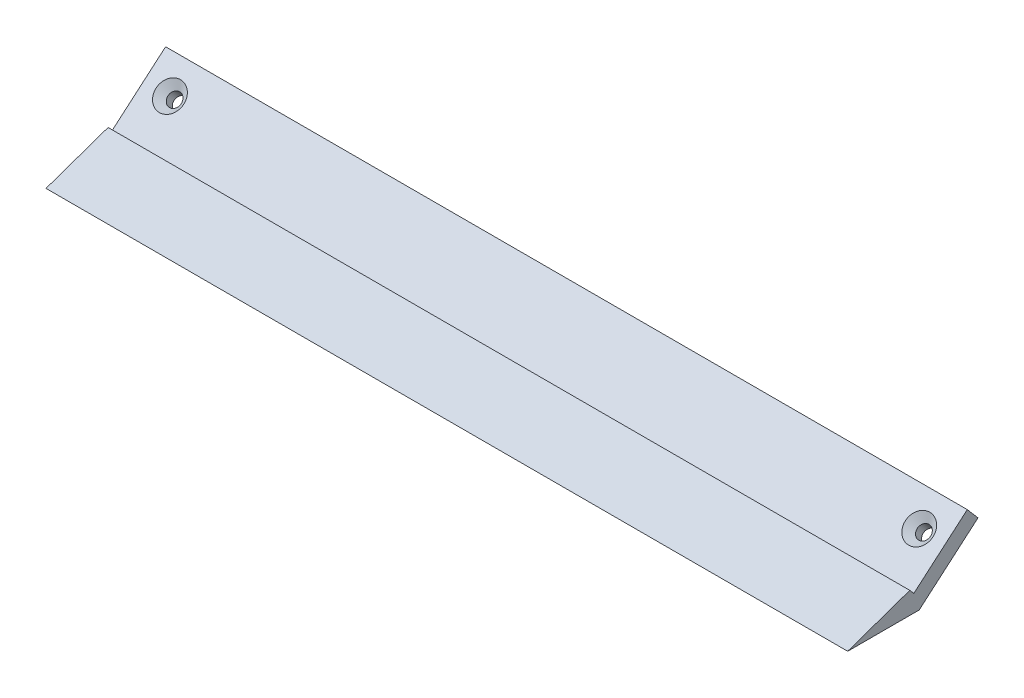
ISO-10303-21;
HEADER;
FILE_DESCRIPTION(('STEP AP214'),'2;1');
FILE_NAME('part.step','',(''),(''),'','','');
FILE_SCHEMA(('AUTOMOTIVE_DESIGN { 1 0 10303 214 1 1 1 1 }'));
ENDSEC;
DATA;
#1=APPLICATION_CONTEXT('core data for automotive mechanical design processes');
#2=APPLICATION_PROTOCOL_DEFINITION('international standard','automotive_design',2000,#1);
#3=PRODUCT_CONTEXT('',#1,'mechanical');
#4=PRODUCT('Part','Part','',(#3));
#5=PRODUCT_RELATED_PRODUCT_CATEGORY('part','',(#4));
#6=PRODUCT_DEFINITION_FORMATION('','',#4);
#7=PRODUCT_DEFINITION_CONTEXT('part definition',#1,'design');
#8=PRODUCT_DEFINITION('design','',#6,#7);
#9=PRODUCT_DEFINITION_SHAPE('','',#8);
#10=(LENGTH_UNIT() NAMED_UNIT(*) SI_UNIT(.MILLI.,.METRE.));
#11=(NAMED_UNIT(*) PLANE_ANGLE_UNIT() SI_UNIT($,.RADIAN.));
#12=(NAMED_UNIT(*) SI_UNIT($,.STERADIAN.) SOLID_ANGLE_UNIT());
#13=UNCERTAINTY_MEASURE_WITH_UNIT(LENGTH_MEASURE(1.E-05),#10,'distance_accuracy_value','');
#14=(GEOMETRIC_REPRESENTATION_CONTEXT(3) GLOBAL_UNCERTAINTY_ASSIGNED_CONTEXT((#13)) GLOBAL_UNIT_ASSIGNED_CONTEXT((#10,
#11,#12)) REPRESENTATION_CONTEXT('',''));
#15=CARTESIAN_POINT('',(0.,0.,0.));
#16=DIRECTION('',(0.,0.,1.));
#17=DIRECTION('',(1.,0.,0.));
#18=AXIS2_PLACEMENT_3D('',#15,#16,#17);
#19=CARTESIAN_POINT('',(67.3005241778361,-8.84385566163832,227.246629625745));
#20=DIRECTION('',(0.,0.759271307334884,0.650774217265847));
#21=DIRECTION('',(0.,-0.650774217265847,0.759271307334885));
#22=AXIS2_PLACEMENT_3D('',#19,#20,#21);
#23=PLANE('',#22);
#24=DIRECTION('',(1.,0.,0.));
#25=VECTOR('',#24,1.);
#26=CARTESIAN_POINT('',(67.3005241778361,2.30815517426496,214.235355327934));
#27=LINE('',#26,#25);
#28=CARTESIAN_POINT('',(-127.699475822164,2.30815517426495,214.235355327934));
#29=VERTEX_POINT('',#28);
#30=CARTESIAN_POINT('',(67.3005241778361,2.30815517426496,214.235355327934));
#31=VERTEX_POINT('',#30);
#32=EDGE_CURVE('E55',#29,#31,#27,.T.);
#33=ORIENTED_EDGE('',*,*,#32,.F.);
#34=DIRECTION('',(0.,0.650774217265847,-0.759271307334884));
#35=VECTOR('',#34,1.);
#36=CARTESIAN_POINT('',(-127.699475822164,-8.84385566163832,227.246629625745));
#37=LINE('',#36,#35);
#38=CARTESIAN_POINT('',(-127.699475822164,-8.84385566163832,227.246629625745));
#39=VERTEX_POINT('',#38);
#40=EDGE_CURVE('E109',#39,#29,#37,.T.);
#41=ORIENTED_EDGE('',*,*,#40,.F.);
#42=DIRECTION('',(-1.,0.,0.));
#43=VECTOR('',#42,1.);
#44=CARTESIAN_POINT('',(67.3005241778361,-8.84385566163832,227.246629625745));
#45=LINE('',#44,#43);
#46=CARTESIAN_POINT('',(67.3005241778361,-8.84385566163832,227.246629625745));
#47=VERTEX_POINT('',#46);
#48=EDGE_CURVE('E64',#47,#39,#45,.T.);
#49=ORIENTED_EDGE('',*,*,#48,.F.);
#50=DIRECTION('',(0.,0.650774217265847,-0.759271307334884));
#51=VECTOR('',#50,1.);
#52=CARTESIAN_POINT('',(67.3005241778361,-8.84385566163832,227.246629625745));
#53=LINE('',#52,#51);
#54=EDGE_CURVE('E111',#47,#31,#53,.T.);
#55=ORIENTED_EDGE('',*,*,#54,.T.);
#56=EDGE_LOOP('',(#33,#41,#49,#55));
#57=FACE_BOUND('',#56,.T.);
#58=CARTESIAN_POINT('',(60.9255241778361,-2.24726434659597,219.550254479279));
#59=DIRECTION('',(0.,0.759271307334884,0.650774217265847));
#60=DIRECTION('',(0.,-0.650774217265847,0.759271307334885));
#61=AXIS2_PLACEMENT_3D('',#58,#59,#60);
#62=CIRCLE('',#61,3.37499999999997);
#63=CARTESIAN_POINT('',(60.9255241778361,-4.44362732986818,222.112795141534));
#64=VERTEX_POINT('',#63);
#65=EDGE_CURVE('E134',#64,#64,#62,.F.);
#66=ORIENTED_EDGE('',*,*,#65,.T.);
#67=EDGE_LOOP('',(#66));
#68=FACE_BOUND('',#67,.T.);
#69=CARTESIAN_POINT('',(-121.324475822164,-2.24726434659598,219.550254479279));
#70=DIRECTION('',(0.,0.759271307334884,0.650774217265847));
#71=DIRECTION('',(0.,-0.650774217265847,0.759271307334885));
#72=AXIS2_PLACEMENT_3D('',#69,#70,#71);
#73=CIRCLE('',#72,3.37500000000002);
#74=CARTESIAN_POINT('',(-121.324475822164,-4.44362732986823,222.112795141534));
#75=VERTEX_POINT('',#74);
#76=EDGE_CURVE('E125',#75,#75,#73,.F.);
#77=ORIENTED_EDGE('',*,*,#76,.T.);
#78=EDGE_LOOP('',(#77));
#79=FACE_BOUND('',#78,.T.);
#80=ADVANCED_FACE('F40',(#57,#68,#79),#23,.T.);
#81=CARTESIAN_POINT('',(67.3005241778361,-10.4905433140623,223.021328068894));
#82=DIRECTION('',(0.,-0.759271307334885,-0.650774217265846));
#83=DIRECTION('',(0.,0.650774217265846,-0.759271307334885));
#84=AXIS2_PLACEMENT_3D('',#81,#82,#83);
#85=PLANE('',#84);
#86=DIRECTION('',(-1.,0.,0.));
#87=VECTOR('',#86,1.);
#88=CARTESIAN_POINT('',(67.3005241778361,-0.728930055074597,211.632258458871));
#89=LINE('',#88,#87);
#90=CARTESIAN_POINT('',(67.3005241778361,-0.728930055074569,211.632258458871));
#91=VERTEX_POINT('',#90);
#92=CARTESIAN_POINT('',(-127.699475822164,-0.728930055074597,211.632258458871));
#93=VERTEX_POINT('',#92);
#94=EDGE_CURVE('E103',#91,#93,#89,.T.);
#95=ORIENTED_EDGE('',*,*,#94,.F.);
#96=DIRECTION('',(0.,-0.650774217265847,0.759271307334884));
#97=VECTOR('',#96,1.);
#98=CARTESIAN_POINT('',(67.3005241778361,3.27881211758387,206.956345433797));
#99=LINE('',#98,#97);
#100=CARTESIAN_POINT('',(67.3005241778361,-12.9905433140623,225.938128117169));
#101=VERTEX_POINT('',#100);
#102=EDGE_CURVE('E91',#91,#101,#99,.T.);
#103=ORIENTED_EDGE('',*,*,#102,.T.);
#104=DIRECTION('',(-1.,0.,0.));
#105=VECTOR('',#104,1.);
#106=CARTESIAN_POINT('',(67.3005241778361,-12.9905433140623,225.938128117169));
#107=LINE('',#106,#105);
#108=CARTESIAN_POINT('',(-127.699475822164,-12.9905433140623,225.938128117169));
#109=VERTEX_POINT('',#108);
#110=EDGE_CURVE('E130',#101,#109,#107,.T.);
#111=ORIENTED_EDGE('',*,*,#110,.T.);
#112=DIRECTION('',(0.,-0.650774217265846,0.759271307334885));
#113=VECTOR('',#112,1.);
#114=CARTESIAN_POINT('',(-127.699475822164,-10.4905433140623,223.021328068894));
#115=LINE('',#114,#113);
#116=EDGE_CURVE('E309',#93,#109,#115,.T.);
#117=ORIENTED_EDGE('',*,*,#116,.F.);
#118=EDGE_LOOP('',(#95,#103,#111,#117));
#119=FACE_BOUND('',#118,.T.);
#120=CARTESIAN_POINT('',(-121.324475822164,-5.28434957593553,216.947157610215));
#121=DIRECTION('',(0.,0.759271307334885,0.650774217265847));
#122=DIRECTION('',(0.,-0.650774217265847,0.759271307334885));
#123=AXIS2_PLACEMENT_3D('',#120,#121,#122);
#124=CIRCLE('',#123,1.62500000000002);
#125=CARTESIAN_POINT('',(-121.324475822164,-6.34185767899254,218.180973484634));
#126=VERTEX_POINT('',#125);
#127=EDGE_CURVE('E313',#126,#126,#124,.F.);
#128=ORIENTED_EDGE('',*,*,#127,.F.);
#129=EDGE_LOOP('',(#128));
#130=FACE_BOUND('',#129,.T.);
#131=CARTESIAN_POINT('',(60.9255241778361,-5.28434957593551,216.947157610215));
#132=DIRECTION('',(0.,0.759271307334885,0.650774217265846));
#133=DIRECTION('',(0.,-0.650774217265846,0.759271307334885));
#134=AXIS2_PLACEMENT_3D('',#131,#132,#133);
#135=CIRCLE('',#134,1.62500000000002);
#136=CARTESIAN_POINT('',(60.9255241778361,-6.34185767899252,218.180973484634));
#137=VERTEX_POINT('',#136);
#138=EDGE_CURVE('E112',#137,#137,#135,.F.);
#139=ORIENTED_EDGE('',*,*,#138,.F.);
#140=EDGE_LOOP('',(#139));
#141=FACE_BOUND('',#140,.T.);
#142=ADVANCED_FACE('F150',(#119,#130,#141),#85,.T.);
#143=CARTESIAN_POINT('',(-121.324475822164,-12.8770626492844,210.439415437557));
#144=DIRECTION('',(0.,0.759271307334884,0.650774217265847));
#145=DIRECTION('',(0.,0.650774217265847,-0.759271307334884));
#146=AXIS2_PLACEMENT_3D('',#143,#144,#145);
#147=CYLINDRICAL_SURFACE('',#146,1.62500000000002);
#148=ORIENTED_EDGE('',*,*,#127,.T.);
#149=EDGE_LOOP('',(#148));
#150=FACE_BOUND('',#149,.T.);
#151=CARTESIAN_POINT('',(-121.324475822164,-3.57598913443204,218.411399599063));
#152=DIRECTION('',(0.,0.759271307334885,0.650774217265846));
#153=DIRECTION('',(0.,-0.650774217265846,0.759271307334885));
#154=AXIS2_PLACEMENT_3D('',#151,#152,#153);
#155=CIRCLE('',#154,1.62500000000002);
#156=CARTESIAN_POINT('',(-121.324475822164,-4.63349723748905,219.645215473483));
#157=VERTEX_POINT('',#156);
#158=EDGE_CURVE('E49',#157,#157,#155,.T.);
#159=ORIENTED_EDGE('',*,*,#158,.T.);
#160=EDGE_LOOP('',(#159));
#161=FACE_BOUND('',#160,.T.);
#162=ADVANCED_FACE('F142',(#150,#161),#147,.F.);
#163=CARTESIAN_POINT('',(-127.699475822164,-10.4905433140623,150.238128118894));
#164=DIRECTION('',(-1.,0.,0.));
#165=DIRECTION('',(0.,-1.,0.));
#166=AXIS2_PLACEMENT_3D('',#163,#164,#165);
#167=PLANE('',#166);
#168=DIRECTION('',(0.,-0.759271307334883,-0.650774217265848));
#169=VECTOR('',#168,1.);
#170=CARTESIAN_POINT('',(-127.699475822164,-9.16225012933407,204.404028948207));
#171=LINE('',#170,#169);
#172=EDGE_CURVE('E101',#29,#93,#171,.T.);
#173=ORIENTED_EDGE('',*,*,#172,.T.);
#174=ORIENTED_EDGE('',*,*,#116,.T.);
#175=DIRECTION('',(0.,0.,1.));
#176=VECTOR('',#175,1.);
#177=CARTESIAN_POINT('',(-127.699475822164,-12.9905433140623,225.938128117169));
#178=LINE('',#177,#176);
#179=CARTESIAN_POINT('',(-127.699475822164,-12.9905433140623,243.324528917273));
#180=VERTEX_POINT('',#179);
#181=EDGE_CURVE('E325',#109,#180,#178,.T.);
#182=ORIENTED_EDGE('',*,*,#181,.T.);
#183=DIRECTION('',(0.,0.330349663339146,-0.943858622851809));
#184=VECTOR('',#183,1.);
#185=CARTESIAN_POINT('',(-127.699475822164,-12.9905433140623,243.324528917273));
#186=LINE('',#185,#184);
#187=CARTESIAN_POINT('',(-127.699475822164,-7.704948700636,228.222790951644));
#188=VERTEX_POINT('',#187);
#189=EDGE_CURVE('E120',#180,#188,#186,.T.);
#190=ORIENTED_EDGE('',*,*,#189,.T.);
#191=DIRECTION('',(0.,-0.759271307334883,-0.650774217265848));
#192=VECTOR('',#191,1.);
#193=CARTESIAN_POINT('',(-127.699475822164,-7.704948700636,228.222790951644));
#194=LINE('',#193,#192);
#195=EDGE_CURVE('E116',#188,#39,#194,.T.);
#196=ORIENTED_EDGE('',*,*,#195,.T.);
#197=ORIENTED_EDGE('',*,*,#40,.T.);
#198=EDGE_LOOP('',(#173,#174,#182,#190,#196,#197));
#199=FACE_BOUND('',#198,.T.);
#200=ADVANCED_FACE('F114',(#199),#167,.T.);
#201=CARTESIAN_POINT('',(67.3005241778361,-10.4905433140623,150.238128118894));
#202=DIRECTION('',(1.,0.,0.));
#203=DIRECTION('',(0.,0.,-1.));
#204=AXIS2_PLACEMENT_3D('',#201,#202,#203);
#205=PLANE('',#204);
#206=DIRECTION('',(0.,-0.759271307334883,-0.650774217265848));
#207=VECTOR('',#206,1.);
#208=CARTESIAN_POINT('',(67.3005241778361,-36.6921419966192,180.808057839761));
#209=LINE('',#208,#207);
#210=EDGE_CURVE('E11',#31,#91,#209,.T.);
#211=ORIENTED_EDGE('',*,*,#210,.F.);
#212=ORIENTED_EDGE('',*,*,#54,.F.);
#213=DIRECTION('',(0.,-0.759271307334883,-0.650774217265848));
#214=VECTOR('',#213,1.);
#215=CARTESIAN_POINT('',(67.3005241778361,-7.704948700636,228.222790951644));
#216=LINE('',#215,#214);
#217=CARTESIAN_POINT('',(67.3005241778361,-7.704948700636,228.222790951644));
#218=VERTEX_POINT('',#217);
#219=EDGE_CURVE('E321',#218,#47,#216,.T.);
#220=ORIENTED_EDGE('',*,*,#219,.F.);
#221=DIRECTION('',(0.,0.330349663339146,-0.943858622851809));
#222=VECTOR('',#221,1.);
#223=CARTESIAN_POINT('',(67.3005241778361,-12.9905433140623,243.324528917273));
#224=LINE('',#223,#222);
#225=CARTESIAN_POINT('',(67.3005241778361,-12.9905433140623,243.324528917273));
#226=VERTEX_POINT('',#225);
#227=EDGE_CURVE('E318',#226,#218,#224,.T.);
#228=ORIENTED_EDGE('',*,*,#227,.F.);
#229=DIRECTION('',(0.,0.,1.));
#230=VECTOR('',#229,1.);
#231=CARTESIAN_POINT('',(67.3005241778361,-12.9905433140623,225.938128117169));
#232=LINE('',#231,#230);
#233=EDGE_CURVE('E118',#101,#226,#232,.T.);
#234=ORIENTED_EDGE('',*,*,#233,.F.);
#235=ORIENTED_EDGE('',*,*,#102,.F.);
#236=EDGE_LOOP('',(#211,#212,#220,#228,#234,#235));
#237=FACE_BOUND('',#236,.T.);
#238=ADVANCED_FACE('F159',(#237),#205,.T.);
#239=CARTESIAN_POINT('',(67.3005241778361,-12.9905433140623,225.938128117169));
#240=DIRECTION('',(0.,-1.,0.));
#241=DIRECTION('',(0.,0.,-1.));
#242=AXIS2_PLACEMENT_3D('',#239,#240,#241);
#243=PLANE('',#242);
#244=ORIENTED_EDGE('',*,*,#181,.F.);
#245=ORIENTED_EDGE('',*,*,#110,.F.);
#246=ORIENTED_EDGE('',*,*,#233,.T.);
#247=DIRECTION('',(-1.,0.,0.));
#248=VECTOR('',#247,1.);
#249=CARTESIAN_POINT('',(67.3005241778361,-12.9905433140623,243.324528917273));
#250=LINE('',#249,#248);
#251=EDGE_CURVE('E128',#226,#180,#250,.T.);
#252=ORIENTED_EDGE('',*,*,#251,.T.);
#253=EDGE_LOOP('',(#244,#245,#246,#252));
#254=FACE_BOUND('',#253,.T.);
#255=ADVANCED_FACE('F168',(#254),#243,.T.);
#256=CARTESIAN_POINT('',(67.3005241778361,-12.9905433140623,243.324528917273));
#257=DIRECTION('',(0.,0.943858622851809,0.330349663339146));
#258=DIRECTION('',(0.,-0.330349663339146,0.943858622851809));
#259=AXIS2_PLACEMENT_3D('',#256,#257,#258);
#260=PLANE('',#259);
#261=ORIENTED_EDGE('',*,*,#189,.F.);
#262=ORIENTED_EDGE('',*,*,#251,.F.);
#263=ORIENTED_EDGE('',*,*,#227,.T.);
#264=DIRECTION('',(-1.,0.,0.));
#265=VECTOR('',#264,1.);
#266=CARTESIAN_POINT('',(67.3005241778361,-7.704948700636,228.222790951644));
#267=LINE('',#266,#265);
#268=EDGE_CURVE('E126',#218,#188,#267,.T.);
#269=ORIENTED_EDGE('',*,*,#268,.T.);
#270=EDGE_LOOP('',(#261,#262,#263,#269));
#271=FACE_BOUND('',#270,.T.);
#272=ADVANCED_FACE('F165',(#271),#260,.T.);
#273=CARTESIAN_POINT('',(67.3005241778361,-7.704948700636,228.222790951644));
#274=DIRECTION('',(0.,0.650774217265848,-0.759271307334883));
#275=DIRECTION('',(0.,0.759271307334883,0.650774217265848));
#276=AXIS2_PLACEMENT_3D('',#273,#274,#275);
#277=PLANE('',#276);
#278=ORIENTED_EDGE('',*,*,#195,.F.);
#279=ORIENTED_EDGE('',*,*,#268,.F.);
#280=ORIENTED_EDGE('',*,*,#219,.T.);
#281=ORIENTED_EDGE('',*,*,#48,.T.);
#282=EDGE_LOOP('',(#278,#279,#280,#281));
#283=FACE_BOUND('',#282,.T.);
#284=ADVANCED_FACE('F161',(#283),#277,.T.);
#285=CARTESIAN_POINT('',(60.9255241778361,-12.8770626492843,210.439415437557));
#286=DIRECTION('',(0.,0.759271307334884,0.650774217265847));
#287=DIRECTION('',(0.,0.650774217265847,-0.759271307334884));
#288=AXIS2_PLACEMENT_3D('',#285,#286,#287);
#289=CYLINDRICAL_SURFACE('',#288,1.62500000000002);
#290=ORIENTED_EDGE('',*,*,#138,.T.);
#291=EDGE_LOOP('',(#290));
#292=FACE_BOUND('',#291,.T.);
#293=CARTESIAN_POINT('',(60.9255241778361,-3.57598913443201,218.411399599063));
#294=DIRECTION('',(0.,0.759271307334884,0.650774217265847));
#295=DIRECTION('',(0.,-0.650774217265847,0.759271307334884));
#296=AXIS2_PLACEMENT_3D('',#293,#294,#295);
#297=CIRCLE('',#296,1.62500000000002);
#298=CARTESIAN_POINT('',(60.9255241778361,-4.63349723748902,219.645215473483));
#299=VERTEX_POINT('',#298);
#300=EDGE_CURVE('E137',#299,#299,#297,.T.);
#301=ORIENTED_EDGE('',*,*,#300,.T.);
#302=EDGE_LOOP('',(#301));
#303=FACE_BOUND('',#302,.T.);
#304=ADVANCED_FACE('F164',(#292,#303),#289,.F.);
#305=CARTESIAN_POINT('',(60.9255241778361,-2.24726434659596,219.550254479279));
#306=DIRECTION('',(0.,0.759271307334884,0.650774217265847));
#307=DIRECTION('',(0.,-0.650774217265847,0.759271307334884));
#308=AXIS2_PLACEMENT_3D('',#305,#306,#307);
#309=CONICAL_SURFACE('',#308,3.37499999999998,0.785398163397439);
#310=ORIENTED_EDGE('',*,*,#300,.F.);
#311=EDGE_LOOP('',(#310));
#312=FACE_BOUND('',#311,.T.);
#313=ORIENTED_EDGE('',*,*,#65,.F.);
#314=EDGE_LOOP('',(#313));
#315=FACE_BOUND('',#314,.T.);
#316=ADVANCED_FACE('F146',(#312,#315),#309,.F.);
#317=CARTESIAN_POINT('',(-121.324475822164,-2.24726434659598,219.550254479279));
#318=DIRECTION('',(0.,0.759271307334885,0.650774217265846));
#319=DIRECTION('',(0.,-0.650774217265846,0.759271307334885));
#320=AXIS2_PLACEMENT_3D('',#317,#318,#319);
#321=CONICAL_SURFACE('',#320,3.37500000000003,0.785398163397446);
#322=ORIENTED_EDGE('',*,*,#158,.F.);
#323=EDGE_LOOP('',(#322));
#324=FACE_BOUND('',#323,.T.);
#325=ORIENTED_EDGE('',*,*,#76,.F.);
#326=EDGE_LOOP('',(#325));
#327=FACE_BOUND('',#326,.T.);
#328=ADVANCED_FACE('F43',(#324,#327),#321,.F.);
#329=CARTESIAN_POINT('',(-127.699475822164,-9.16225012933407,204.404028948207));
#330=DIRECTION('',(0.,-0.650774217265848,0.759271307334883));
#331=DIRECTION('',(0.,-0.759271307334883,-0.650774217265848));
#332=AXIS2_PLACEMENT_3D('',#329,#330,#331);
#333=PLANE('',#332);
#334=ORIENTED_EDGE('',*,*,#32,.T.);
#335=ORIENTED_EDGE('',*,*,#210,.T.);
#336=ORIENTED_EDGE('',*,*,#94,.T.);
#337=ORIENTED_EDGE('',*,*,#172,.F.);
#338=EDGE_LOOP('',(#334,#335,#336,#337));
#339=FACE_BOUND('',#338,.T.);
#340=ADVANCED_FACE('F102',(#339),#333,.F.);
#341=CLOSED_SHELL('',(#80,#142,#162,#200,#238,#255,#272,#284,#304,#316,#328,#340));
#342=MANIFOLD_SOLID_BREP('B2',#341);
#343=ADVANCED_BREP_SHAPE_REPRESENTATION('',(#18,#342),#14);
#344=SHAPE_DEFINITION_REPRESENTATION(#9,#343);
ENDSEC;
END-ISO-10303-21;
